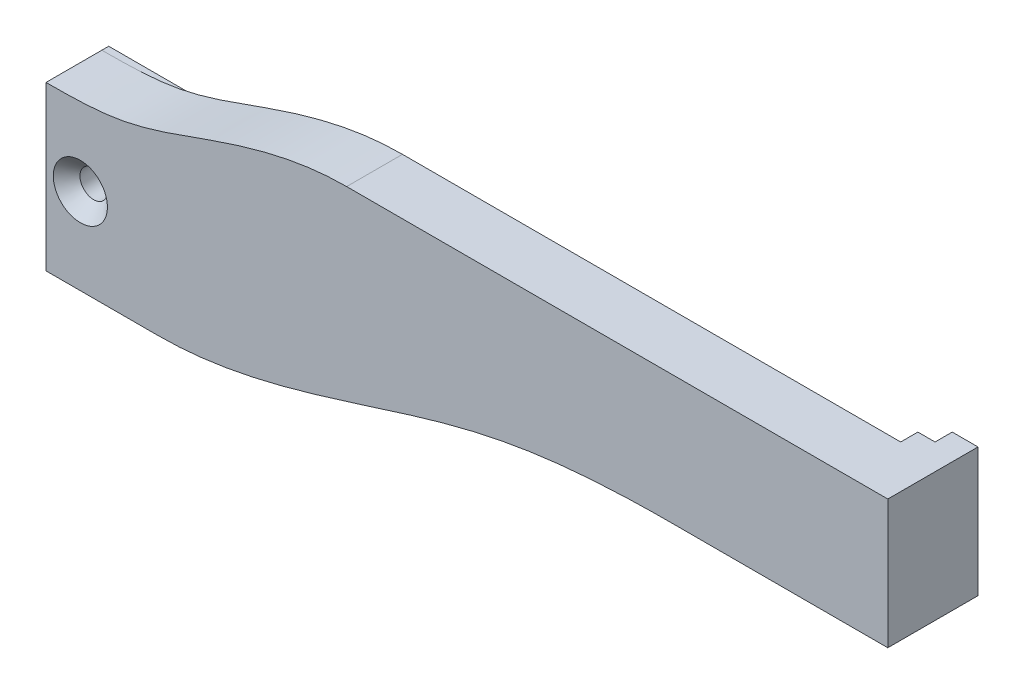
ISO-10303-21;
HEADER;
FILE_DESCRIPTION(('STEP AP214'),'2;1');
FILE_NAME('part.step','',(''),(''),'','','');
FILE_SCHEMA(('AUTOMOTIVE_DESIGN { 1 0 10303 214 1 1 1 1 }'));
ENDSEC;
DATA;
#1=APPLICATION_CONTEXT('core data for automotive mechanical design processes');
#2=APPLICATION_PROTOCOL_DEFINITION('international standard','automotive_design',2000,#1);
#3=PRODUCT_CONTEXT('',#1,'mechanical');
#4=PRODUCT('Part','Part','',(#3));
#5=PRODUCT_RELATED_PRODUCT_CATEGORY('part','',(#4));
#6=PRODUCT_DEFINITION_FORMATION('','',#4);
#7=PRODUCT_DEFINITION_CONTEXT('part definition',#1,'design');
#8=PRODUCT_DEFINITION('design','',#6,#7);
#9=PRODUCT_DEFINITION_SHAPE('','',#8);
#10=(LENGTH_UNIT() NAMED_UNIT(*) SI_UNIT(.MILLI.,.METRE.));
#11=(NAMED_UNIT(*) PLANE_ANGLE_UNIT() SI_UNIT($,.RADIAN.));
#12=(NAMED_UNIT(*) SI_UNIT($,.STERADIAN.) SOLID_ANGLE_UNIT());
#13=UNCERTAINTY_MEASURE_WITH_UNIT(LENGTH_MEASURE(1.E-05),#10,'distance_accuracy_value','');
#14=(GEOMETRIC_REPRESENTATION_CONTEXT(3) GLOBAL_UNCERTAINTY_ASSIGNED_CONTEXT((#13)) GLOBAL_UNIT_ASSIGNED_CONTEXT((#10,
#11,#12)) REPRESENTATION_CONTEXT('',''));
#15=CARTESIAN_POINT('',(0.,0.,0.));
#16=DIRECTION('',(0.,0.,1.));
#17=DIRECTION('',(1.,0.,0.));
#18=AXIS2_PLACEMENT_3D('',#15,#16,#17);
#19=CARTESIAN_POINT('',(0.,0.,0.));
#20=DIRECTION('',(0.,0.,-1.));
#21=DIRECTION('',(-1.,0.,0.));
#22=AXIS2_PLACEMENT_3D('',#19,#20,#21);
#23=PLANE('',#22);
#24=CARTESIAN_POINT('',(-49.7226680854989,56.4584902718559,0.));
#25=DIRECTION('',(0.,0.,-1.));
#26=DIRECTION('',(-1.,0.,0.));
#27=AXIS2_PLACEMENT_3D('',#24,#25,#26);
#28=CIRCLE('',#27,1.59999999999999);
#29=CARTESIAN_POINT('',(-51.3226680854989,56.4584902718559,0.));
#30=VERTEX_POINT('',#29);
#31=EDGE_CURVE('E40',#30,#30,#28,.T.);
#32=ORIENTED_EDGE('',*,*,#31,.F.);
#33=EDGE_LOOP('',(#32));
#34=FACE_BOUND('',#33,.T.);
#35=CARTESIAN_POINT('',(-44.1226680854821,62.0584902718545,0.));
#36=DIRECTION('',(0.,0.,1.));
#37=DIRECTION('',(-1.,0.,0.));
#38=AXIS2_PLACEMENT_3D('',#35,#36,#37);
#39=CIRCLE('',#38,0.899999999999998);
#40=CARTESIAN_POINT('',(-43.2226680854821,62.0584902718545,0.));
#41=VERTEX_POINT('',#40);
#42=CARTESIAN_POINT('',(-44.1226680854821,62.9584902718545,0.));
#43=VERTEX_POINT('',#42);
#44=EDGE_CURVE('E246',#41,#43,#39,.T.);
#45=ORIENTED_EDGE('',*,*,#44,.F.);
#46=DIRECTION('',(0.,1.,0.));
#47=VECTOR('',#46,1.);
#48=CARTESIAN_POINT('',(-43.2226680854821,62.0584902718545,0.));
#49=LINE('',#48,#47);
#50=CARTESIAN_POINT('',(-43.2226680854821,46.4584902718545,0.));
#51=VERTEX_POINT('',#50);
#52=EDGE_CURVE('E224',#51,#41,#49,.T.);
#53=ORIENTED_EDGE('',*,*,#52,.F.);
#54=DIRECTION('',(1.,0.,0.));
#55=VECTOR('',#54,1.);
#56=CARTESIAN_POINT('',(-53.7226680854821,46.4584902718545,0.));
#57=LINE('',#56,#55);
#58=CARTESIAN_POINT('',(-53.7226680854821,46.4584902718545,0.));
#59=VERTEX_POINT('',#58);
#60=EDGE_CURVE('E358',#59,#51,#57,.T.);
#61=ORIENTED_EDGE('',*,*,#60,.F.);
#62=DIRECTION('',(0.,-1.,0.));
#63=VECTOR('',#62,1.);
#64=CARTESIAN_POINT('',(-53.7226680854821,46.4584902718545,0.));
#65=LINE('',#64,#63);
#66=CARTESIAN_POINT('',(-53.7226680854821,62.9584902718545,0.));
#67=VERTEX_POINT('',#66);
#68=EDGE_CURVE('E345',#67,#59,#65,.T.);
#69=ORIENTED_EDGE('',*,*,#68,.F.);
#70=DIRECTION('',(-1.,0.,0.));
#71=VECTOR('',#70,1.);
#72=CARTESIAN_POINT('',(-53.7226680854821,62.9584902718545,0.));
#73=LINE('',#72,#71);
#74=EDGE_CURVE('E248',#43,#67,#73,.T.);
#75=ORIENTED_EDGE('',*,*,#74,.F.);
#76=EDGE_LOOP('',(#45,#53,#61,#69,#75));
#77=FACE_BOUND('',#76,.T.);
#78=ADVANCED_FACE('F35',(#34,#77),#23,.T.);
#79=CARTESIAN_POINT('',(-19.6476680854999,68.8834902718559,0.));
#80=DIRECTION('',(0.,0.,-1.));
#81=DIRECTION('',(-1.,0.,0.));
#82=AXIS2_PLACEMENT_3D('',#79,#80,#81);
#83=CIRCLE('',#82,2.);
#84=CARTESIAN_POINT('',(-21.6476680854999,68.8834902718559,0.));
#85=VERTEX_POINT('',#84);
#86=EDGE_CURVE('E526',#85,#85,#83,.T.);
#87=ORIENTED_EDGE('',*,*,#86,.F.);
#88=EDGE_LOOP('',(#87));
#89=FACE_BOUND('',#88,.T.);
#90=DIRECTION('',(0.707106781186547,-0.707106781186547,0.));
#91=VECTOR('',#90,1.);
#92=CARTESIAN_POINT('',(-40.7226680854821,64.9584902718545,0.));
#93=LINE('',#92,#91);
#94=CARTESIAN_POINT('',(-41.2226680854821,65.4584902718545,0.));
#95=VERTEX_POINT('',#94);
#96=CARTESIAN_POINT('',(-40.7226680854821,64.9584902718545,0.));
#97=VERTEX_POINT('',#96);
#98=EDGE_CURVE('E252',#95,#97,#93,.T.);
#99=ORIENTED_EDGE('',*,*,#98,.F.);
#100=DIRECTION('',(1.,0.,0.));
#101=VECTOR('',#100,1.);
#102=CARTESIAN_POINT('',(-41.2226680854821,65.4584902718545,0.));
#103=LINE('',#102,#101);
#104=CARTESIAN_POINT('',(-53.7226680854821,65.4584902718545,0.));
#105=VERTEX_POINT('',#104);
#106=EDGE_CURVE('E250',#105,#95,#103,.T.);
#107=ORIENTED_EDGE('',*,*,#106,.F.);
#108=CARTESIAN_POINT('',(-18.7226680854821,72.4584902718545,0.));
#109=CARTESIAN_POINT('',(-24.2377853639958,72.4584902718545,0.));
#110=CARTESIAN_POINT('',(-33.0451653637559,69.9964648024946,0.));
#111=CARTESIAN_POINT('',(-44.1783998760169,65.5488965573523,0.));
#112=CARTESIAN_POINT('',(-50.961091510957,65.4584902718545,0.));
#113=CARTESIAN_POINT('',(-53.7226680854821,65.4584902718545,0.));
#114=B_SPLINE_CURVE_WITH_KNOTS('',3,(#108,#109,#110,#111,#112,#113),.UNSPECIFIED.,.F.,.F.,(4,1,
1,4),(0.,0.451492406228631,0.761184280868583,1.),.UNSPECIFIED.);
#115=CARTESIAN_POINT('',(-18.7226680854821,72.4584902718545,0.));
#116=VERTEX_POINT('',#115);
#117=EDGE_CURVE('E367',#116,#105,#114,.T.);
#118=ORIENTED_EDGE('',*,*,#117,.F.);
#119=DIRECTION('',(-1.,0.,0.));
#120=VECTOR('',#119,1.);
#121=CARTESIAN_POINT('',(-53.7226680854821,72.4584902718545,0.));
#122=LINE('',#121,#120);
#123=CARTESIAN_POINT('',(39.2773319145179,72.4584902718545,0.));
#124=VERTEX_POINT('',#123);
#125=EDGE_CURVE('E349',#124,#116,#122,.T.);
#126=ORIENTED_EDGE('',*,*,#125,.F.);
#127=DIRECTION('',(0.,1.,0.));
#128=VECTOR('',#127,1.);
#129=CARTESIAN_POINT('',(39.2773319145179,70.4584902718545,0.));
#130=LINE('',#129,#128);
#131=CARTESIAN_POINT('',(39.2773319145179,70.4584902718545,0.));
#132=VERTEX_POINT('',#131);
#133=EDGE_CURVE('E333',#132,#124,#130,.T.);
#134=ORIENTED_EDGE('',*,*,#133,.F.);
#135=DIRECTION('',(-1.,0.,0.));
#136=VECTOR('',#135,1.);
#137=CARTESIAN_POINT('',(42.2773319145179,70.4584902718545,0.));
#138=LINE('',#137,#136);
#139=CARTESIAN_POINT('',(42.2773319145179,70.4584902718545,0.));
#140=VERTEX_POINT('',#139);
#141=EDGE_CURVE('E330',#140,#132,#138,.T.);
#142=ORIENTED_EDGE('',*,*,#141,.F.);
#143=DIRECTION('',(0.,1.,0.));
#144=VECTOR('',#143,1.);
#145=CARTESIAN_POINT('',(42.2773319145179,57.4584902718545,0.));
#146=LINE('',#145,#144);
#147=CARTESIAN_POINT('',(42.2773319145179,57.4584902718545,0.));
#148=VERTEX_POINT('',#147);
#149=EDGE_CURVE('E320',#148,#140,#146,.T.);
#150=ORIENTED_EDGE('',*,*,#149,.F.);
#151=DIRECTION('',(1.,0.,0.));
#152=VECTOR('',#151,1.);
#153=CARTESIAN_POINT('',(0.,57.4584902718545,0.));
#154=LINE('',#153,#152);
#155=CARTESIAN_POINT('',(19.2773319145179,57.4584902718545,0.));
#156=VERTEX_POINT('',#155);
#157=EDGE_CURVE('E317',#156,#148,#154,.T.);
#158=ORIENTED_EDGE('',*,*,#157,.F.);
#159=CARTESIAN_POINT('',(-40.7226680854821,46.4584902718545,0.));
#160=CARTESIAN_POINT('',(-29.5295788319542,46.4584902718546,0.));
#161=CARTESIAN_POINT('',(-8.90412174148208,55.1540178434076,0.));
#162=CARTESIAN_POINT('',(7.83294299235179,57.4584902718545,0.));
#163=CARTESIAN_POINT('',(19.2773319145179,57.4584902718545,0.));
#164=B_SPLINE_CURVE_WITH_KNOTS('',3,(#159,#160,#161,#162,#163),.UNSPECIFIED.,.F.,.F.,(4,1,4),
(0.,0.551294404892798,1.),.UNSPECIFIED.);
#165=CARTESIAN_POINT('',(-40.7226680854821,46.4584902718545,0.));
#166=VERTEX_POINT('',#165);
#167=EDGE_CURVE('E372',#166,#156,#164,.T.);
#168=ORIENTED_EDGE('',*,*,#167,.F.);
#169=DIRECTION('',(0.,-1.,0.));
#170=VECTOR('',#169,1.);
#171=CARTESIAN_POINT('',(-40.7226680854821,46.4584902718545,0.));
#172=LINE('',#171,#170);
#173=EDGE_CURVE('E229',#97,#166,#172,.T.);
#174=ORIENTED_EDGE('',*,*,#173,.F.);
#175=EDGE_LOOP('',(#99,#107,#118,#126,#134,#142,#150,#158,#168,#174));
#176=FACE_BOUND('',#175,.T.);
#177=ADVANCED_FACE('F413',(#89,#176),#23,.T.);
#178=CARTESIAN_POINT('',(-53.7226680854821,46.4584902718545,6.5));
#179=DIRECTION('',(0.,1.,0.));
#180=DIRECTION('',(0.,0.,1.));
#181=AXIS2_PLACEMENT_3D('',#178,#179,#180);
#182=PLANE('',#181);
#183=DIRECTION('',(0.,0.,-1.));
#184=VECTOR('',#183,1.);
#185=CARTESIAN_POINT('',(-40.7226680854821,46.4584902718545,6.5));
#186=LINE('',#185,#184);
#187=CARTESIAN_POINT('',(-40.7226680854821,46.4584902718545,6.5));
#188=VERTEX_POINT('',#187);
#189=EDGE_CURVE('E310',#188,#166,#186,.T.);
#190=ORIENTED_EDGE('',*,*,#189,.F.);
#191=DIRECTION('',(1.,0.,0.));
#192=VECTOR('',#191,1.);
#193=CARTESIAN_POINT('',(-53.7226680854821,46.4584902718545,6.5));
#194=LINE('',#193,#192);
#195=CARTESIAN_POINT('',(-53.7226680854821,46.4584902718545,6.5));
#196=VERTEX_POINT('',#195);
#197=EDGE_CURVE('E348',#196,#188,#194,.T.);
#198=ORIENTED_EDGE('',*,*,#197,.F.);
#199=DIRECTION('',(0.,0.,-1.));
#200=VECTOR('',#199,1.);
#201=CARTESIAN_POINT('',(-53.7226680854821,46.4584902718545,6.5));
#202=LINE('',#201,#200);
#203=EDGE_CURVE('E364',#196,#59,#202,.T.);
#204=ORIENTED_EDGE('',*,*,#203,.T.);
#205=ORIENTED_EDGE('',*,*,#60,.T.);
#206=DIRECTION('',(0.,0.,1.));
#207=VECTOR('',#206,1.);
#208=CARTESIAN_POINT('',(-43.2226680854821,46.4584902718545,-0.8));
#209=LINE('',#208,#207);
#210=CARTESIAN_POINT('',(-43.2226680854821,46.4584902718545,-0.8));
#211=VERTEX_POINT('',#210);
#212=EDGE_CURVE('E243',#211,#51,#209,.T.);
#213=ORIENTED_EDGE('',*,*,#212,.F.);
#214=DIRECTION('',(-1.,0.,0.));
#215=VECTOR('',#214,1.);
#216=CARTESIAN_POINT('',(-43.2226680854821,46.4584902718545,-0.8));
#217=LINE('',#216,#215);
#218=CARTESIAN_POINT('',(-40.7226680854821,46.4584902718545,-0.8));
#219=VERTEX_POINT('',#218);
#220=EDGE_CURVE('E241',#219,#211,#217,.T.);
#221=ORIENTED_EDGE('',*,*,#220,.F.);
#222=DIRECTION('',(0.,0.,1.));
#223=VECTOR('',#222,1.);
#224=CARTESIAN_POINT('',(-40.7226680854821,46.4584902718545,-0.8));
#225=LINE('',#224,#223);
#226=EDGE_CURVE('E257',#219,#166,#225,.T.);
#227=ORIENTED_EDGE('',*,*,#226,.T.);
#228=EDGE_LOOP('',(#190,#198,#204,#205,#213,#221,#227));
#229=FACE_BOUND('',#228,.T.);
#230=ADVANCED_FACE('F435',(#229),#182,.F.);
#231=CARTESIAN_POINT('',(-53.7226680854821,72.4584902718545,6.5));
#232=DIRECTION('',(0.,-1.,0.));
#233=DIRECTION('',(0.,0.,-1.));
#234=AXIS2_PLACEMENT_3D('',#231,#232,#233);
#235=PLANE('',#234);
#236=DIRECTION('',(0.,0.,-1.));
#237=VECTOR('',#236,1.);
#238=CARTESIAN_POINT('',(-18.7226680854821,72.4584902718545,6.5));
#239=LINE('',#238,#237);
#240=CARTESIAN_POINT('',(-18.7226680854821,72.4584902718545,6.5));
#241=VERTEX_POINT('',#240);
#242=EDGE_CURVE('E283',#241,#116,#239,.T.);
#243=ORIENTED_EDGE('',*,*,#242,.F.);
#244=DIRECTION('',(-1.,0.,0.));
#245=VECTOR('',#244,1.);
#246=CARTESIAN_POINT('',(-53.7226680854821,72.4584902718545,6.5));
#247=LINE('',#246,#245);
#248=CARTESIAN_POINT('',(44.2773319145179,72.4584902718545,6.5));
#249=VERTEX_POINT('',#248);
#250=EDGE_CURVE('E353',#249,#241,#247,.T.);
#251=ORIENTED_EDGE('',*,*,#250,.F.);
#252=DIRECTION('',(0.,0.,-1.));
#253=VECTOR('',#252,1.);
#254=CARTESIAN_POINT('',(44.2773319145179,72.4584902718545,6.5));
#255=LINE('',#254,#253);
#256=CARTESIAN_POINT('',(44.2773319145179,72.4584902718545,-4.));
#257=VERTEX_POINT('',#256);
#258=EDGE_CURVE('E356',#249,#257,#255,.T.);
#259=ORIENTED_EDGE('',*,*,#258,.T.);
#260=DIRECTION('',(1.,0.,0.));
#261=VECTOR('',#260,1.);
#262=CARTESIAN_POINT('',(44.2773319145179,72.4584902718545,-4.));
#263=LINE('',#262,#261);
#264=CARTESIAN_POINT('',(41.2773319145179,72.4584902718545,-4.));
#265=VERTEX_POINT('',#264);
#266=EDGE_CURVE('E206',#265,#257,#263,.T.);
#267=ORIENTED_EDGE('',*,*,#266,.F.);
#268=DIRECTION('',(0.,0.,1.));
#269=VECTOR('',#268,1.);
#270=CARTESIAN_POINT('',(41.2773319145179,72.4584902718545,-4.));
#271=LINE('',#270,#269);
#272=CARTESIAN_POINT('',(41.2773319145179,72.4584902718545,-2.));
#273=VERTEX_POINT('',#272);
#274=EDGE_CURVE('E219',#265,#273,#271,.T.);
#275=ORIENTED_EDGE('',*,*,#274,.T.);
#276=DIRECTION('',(1.,0.,0.));
#277=VECTOR('',#276,1.);
#278=CARTESIAN_POINT('',(39.2773319145179,72.4584902718545,-2.));
#279=LINE('',#278,#277);
#280=CARTESIAN_POINT('',(39.2773319145179,72.4584902718545,-2.));
#281=VERTEX_POINT('',#280);
#282=EDGE_CURVE('E192',#281,#273,#279,.T.);
#283=ORIENTED_EDGE('',*,*,#282,.F.);
#284=DIRECTION('',(0.,0.,1.));
#285=VECTOR('',#284,1.);
#286=CARTESIAN_POINT('',(39.2773319145179,72.4584902718545,-2.));
#287=LINE('',#286,#285);
#288=EDGE_CURVE('E191',#281,#124,#287,.T.);
#289=ORIENTED_EDGE('',*,*,#288,.T.);
#290=ORIENTED_EDGE('',*,*,#125,.T.);
#291=EDGE_LOOP('',(#243,#251,#259,#267,#275,#283,#289,#290));
#292=FACE_BOUND('',#291,.T.);
#293=ADVANCED_FACE('F400',(#292),#235,.F.);
#294=CARTESIAN_POINT('',(-53.7226680854821,46.4584902718545,6.5));
#295=DIRECTION('',(1.,0.,0.));
#296=DIRECTION('',(0.,0.,-1.));
#297=AXIS2_PLACEMENT_3D('',#294,#295,#296);
#298=PLANE('',#297);
#299=DIRECTION('',(0.,-1.,0.));
#300=VECTOR('',#299,1.);
#301=CARTESIAN_POINT('',(-53.7226680854821,46.4584902718545,6.5));
#302=LINE('',#301,#300);
#303=CARTESIAN_POINT('',(-53.7226680854821,65.4584902718545,6.5));
#304=VERTEX_POINT('',#303);
#305=EDGE_CURVE('E346',#304,#196,#302,.T.);
#306=ORIENTED_EDGE('',*,*,#305,.F.);
#307=DIRECTION('',(0.,0.,-1.));
#308=VECTOR('',#307,1.);
#309=CARTESIAN_POINT('',(-53.7226680854821,65.4584902718545,6.5));
#310=LINE('',#309,#308);
#311=EDGE_CURVE('E309',#304,#105,#310,.T.);
#312=ORIENTED_EDGE('',*,*,#311,.T.);
#313=DIRECTION('',(0.,0.,1.));
#314=VECTOR('',#313,1.);
#315=CARTESIAN_POINT('',(-53.7226680854821,65.4584902718545,-0.8));
#316=LINE('',#315,#314);
#317=CARTESIAN_POINT('',(-53.7226680854821,65.4584902718545,-0.8));
#318=VERTEX_POINT('',#317);
#319=EDGE_CURVE('E265',#318,#105,#316,.T.);
#320=ORIENTED_EDGE('',*,*,#319,.F.);
#321=DIRECTION('',(0.,1.,0.));
#322=VECTOR('',#321,1.);
#323=CARTESIAN_POINT('',(-53.7226680854821,65.4584902718545,-0.8));
#324=LINE('',#323,#322);
#325=CARTESIAN_POINT('',(-53.7226680854821,62.9584902718545,-0.8));
#326=VERTEX_POINT('',#325);
#327=EDGE_CURVE('E233',#326,#318,#324,.T.);
#328=ORIENTED_EDGE('',*,*,#327,.F.);
#329=DIRECTION('',(0.,0.,1.));
#330=VECTOR('',#329,1.);
#331=CARTESIAN_POINT('',(-53.7226680854821,62.9584902718545,-0.8));
#332=LINE('',#331,#330);
#333=EDGE_CURVE('E267',#326,#67,#332,.T.);
#334=ORIENTED_EDGE('',*,*,#333,.T.);
#335=ORIENTED_EDGE('',*,*,#68,.T.);
#336=ORIENTED_EDGE('',*,*,#203,.F.);
#337=EDGE_LOOP('',(#306,#312,#320,#328,#334,#335,#336));
#338=FACE_BOUND('',#337,.T.);
#339=ADVANCED_FACE('F444',(#338),#298,.F.);
#340=CARTESIAN_POINT('',(44.2773319145179,46.4584902718545,6.5));
#341=DIRECTION('',(-1.,0.,0.));
#342=DIRECTION('',(0.,-1.,0.));
#343=AXIS2_PLACEMENT_3D('',#340,#341,#342);
#344=PLANE('',#343);
#345=DIRECTION('',(0.,1.,0.));
#346=VECTOR('',#345,1.);
#347=CARTESIAN_POINT('',(44.2773319145179,46.4584902718545,6.5));
#348=LINE('',#347,#346);
#349=CARTESIAN_POINT('',(44.2773319145179,57.4584902718545,6.5));
#350=VERTEX_POINT('',#349);
#351=EDGE_CURVE('E187',#350,#249,#348,.T.);
#352=ORIENTED_EDGE('',*,*,#351,.F.);
#353=DIRECTION('',(0.,0.,1.));
#354=VECTOR('',#353,1.);
#355=CARTESIAN_POINT('',(44.2773319145179,57.4584902718545,-2.));
#356=LINE('',#355,#354);
#357=CARTESIAN_POINT('',(44.2773319145179,57.4584902718545,-4.));
#358=VERTEX_POINT('',#357);
#359=EDGE_CURVE('E181',#358,#350,#356,.T.);
#360=ORIENTED_EDGE('',*,*,#359,.F.);
#361=DIRECTION('',(0.,-1.,0.));
#362=VECTOR('',#361,1.);
#363=CARTESIAN_POINT('',(44.2773319145179,72.4584902718545,-4.));
#364=LINE('',#363,#362);
#365=EDGE_CURVE('E186',#257,#358,#364,.T.);
#366=ORIENTED_EDGE('',*,*,#365,.F.);
#367=ORIENTED_EDGE('',*,*,#258,.F.);
#368=EDGE_LOOP('',(#352,#360,#366,#367));
#369=FACE_BOUND('',#368,.T.);
#370=ADVANCED_FACE('F183',(#369),#344,.F.);
#371=CARTESIAN_POINT('',(0.,0.,6.5));
#372=DIRECTION('',(0.,0.,-1.));
#373=DIRECTION('',(-1.,0.,0.));
#374=AXIS2_PLACEMENT_3D('',#371,#372,#373);
#375=PLANE('',#374);
#376=CARTESIAN_POINT('',(-49.7226680854989,56.4584902718559,6.5));
#377=DIRECTION('',(0.,0.,1.));
#378=DIRECTION('',(1.,0.,0.));
#379=AXIS2_PLACEMENT_3D('',#376,#377,#378);
#380=CIRCLE('',#379,3.15);
#381=CARTESIAN_POINT('',(-46.5726680854989,56.4584902718559,6.5));
#382=VERTEX_POINT('',#381);
#383=EDGE_CURVE('E525',#382,#382,#380,.T.);
#384=ORIENTED_EDGE('',*,*,#383,.F.);
#385=EDGE_LOOP('',(#384));
#386=FACE_BOUND('',#385,.T.);
#387=CARTESIAN_POINT('',(-40.7226680854821,46.4584902718545,6.5));
#388=CARTESIAN_POINT('',(-29.5295788319542,46.4584902718546,6.5));
#389=CARTESIAN_POINT('',(-8.90412174148208,55.1540178434076,6.5));
#390=CARTESIAN_POINT('',(7.83294299235179,57.4584902718545,6.5));
#391=CARTESIAN_POINT('',(19.2773319145179,57.4584902718545,6.5));
#392=B_SPLINE_CURVE_WITH_KNOTS('',3,(#387,#388,#389,#390,#391),.UNSPECIFIED.,.F.,.F.,(4,1,4),
(0.,0.551294404892798,1.),.UNSPECIFIED.);
#393=CARTESIAN_POINT('',(19.2773319145179,57.4584902718545,6.5));
#394=VERTEX_POINT('',#393);
#395=EDGE_CURVE('E276',#188,#394,#392,.T.);
#396=ORIENTED_EDGE('',*,*,#395,.T.);
#397=DIRECTION('',(1.,0.,0.));
#398=VECTOR('',#397,1.);
#399=CARTESIAN_POINT('',(44.2773319145179,57.4584902718545,6.5));
#400=LINE('',#399,#398);
#401=EDGE_CURVE('E282',#394,#350,#400,.T.);
#402=ORIENTED_EDGE('',*,*,#401,.T.);
#403=ORIENTED_EDGE('',*,*,#351,.T.);
#404=ORIENTED_EDGE('',*,*,#250,.T.);
#405=CARTESIAN_POINT('',(-18.7226680854821,72.4584902718545,6.5));
#406=CARTESIAN_POINT('',(-24.2377853639958,72.4584902718545,6.5));
#407=CARTESIAN_POINT('',(-33.0451653637559,69.9964648024946,6.5));
#408=CARTESIAN_POINT('',(-44.1783998760169,65.5488965573523,6.5));
#409=CARTESIAN_POINT('',(-50.961091510957,65.4584902718545,6.5));
#410=CARTESIAN_POINT('',(-53.7226680854821,65.4584902718545,6.5));
#411=B_SPLINE_CURVE_WITH_KNOTS('',3,(#405,#406,#407,#408,#409,#410),.UNSPECIFIED.,.F.,.F.,(4,1,
1,4),(0.,0.451492406228631,0.761184280868583,1.),.UNSPECIFIED.);
#412=EDGE_CURVE('E275',#241,#304,#411,.T.);
#413=ORIENTED_EDGE('',*,*,#412,.T.);
#414=ORIENTED_EDGE('',*,*,#305,.T.);
#415=ORIENTED_EDGE('',*,*,#197,.T.);
#416=EDGE_LOOP('',(#396,#402,#403,#404,#413,#414,#415));
#417=FACE_BOUND('',#416,.T.);
#418=ADVANCED_FACE('F403',(#386,#417),#375,.F.);
#419=CARTESIAN_POINT('',(44.2773319145179,57.4584902718545,-2.));
#420=DIRECTION('',(0.,1.,0.));
#421=DIRECTION('',(0.,0.,1.));
#422=AXIS2_PLACEMENT_3D('',#419,#420,#421);
#423=PLANE('',#422);
#424=ORIENTED_EDGE('',*,*,#359,.T.);
#425=ORIENTED_EDGE('',*,*,#401,.F.);
#426=DIRECTION('',(0.,0.,-1.));
#427=VECTOR('',#426,1.);
#428=CARTESIAN_POINT('',(19.2773319145179,57.4584902718545,6.5));
#429=LINE('',#428,#427);
#430=EDGE_CURVE('E321',#394,#156,#429,.T.);
#431=ORIENTED_EDGE('',*,*,#430,.T.);
#432=ORIENTED_EDGE('',*,*,#157,.T.);
#433=DIRECTION('',(0.,0.,1.));
#434=VECTOR('',#433,1.);
#435=CARTESIAN_POINT('',(42.2773319145179,57.4584902718545,-2.));
#436=LINE('',#435,#434);
#437=CARTESIAN_POINT('',(42.2773319145179,57.4584902718545,-1.2));
#438=VERTEX_POINT('',#437);
#439=EDGE_CURVE('E343',#438,#148,#436,.T.);
#440=ORIENTED_EDGE('',*,*,#439,.F.);
#441=DIRECTION('',(0.707106781186548,0.,0.707106781186548));
#442=VECTOR('',#441,1.);
#443=CARTESIAN_POINT('',(42.8773319145179,57.4584902718545,-0.600000000000002));
#444=LINE('',#443,#442);
#445=CARTESIAN_POINT('',(41.4773319145179,57.4584902718545,-2.));
#446=VERTEX_POINT('',#445);
#447=EDGE_CURVE('E11',#438,#446,#444,.F.);
#448=ORIENTED_EDGE('',*,*,#447,.T.);
#449=DIRECTION('',(-1.,0.,0.));
#450=VECTOR('',#449,1.);
#451=CARTESIAN_POINT('',(44.2773319145179,57.4584902718545,-2.));
#452=LINE('',#451,#450);
#453=CARTESIAN_POINT('',(41.2773319145179,57.4584902718545,-2.));
#454=VERTEX_POINT('',#453);
#455=EDGE_CURVE('E210',#446,#454,#452,.T.);
#456=ORIENTED_EDGE('',*,*,#455,.T.);
#457=DIRECTION('',(0.,0.,1.));
#458=VECTOR('',#457,1.);
#459=CARTESIAN_POINT('',(41.2773319145179,57.4584902718545,-4.));
#460=LINE('',#459,#458);
#461=CARTESIAN_POINT('',(41.2773319145179,57.4584902718545,-4.));
#462=VERTEX_POINT('',#461);
#463=EDGE_CURVE('E198',#462,#454,#460,.T.);
#464=ORIENTED_EDGE('',*,*,#463,.F.);
#465=DIRECTION('',(-1.,0.,0.));
#466=VECTOR('',#465,1.);
#467=CARTESIAN_POINT('',(44.2773319145179,57.4584902718545,-4.));
#468=LINE('',#467,#466);
#469=EDGE_CURVE('E195',#358,#462,#468,.T.);
#470=ORIENTED_EDGE('',*,*,#469,.F.);
#471=EDGE_LOOP('',(#424,#425,#431,#432,#440,#448,#456,#464,#470));
#472=FACE_BOUND('',#471,.T.);
#473=ADVANCED_FACE('F196',(#472),#423,.F.);
#474=CARTESIAN_POINT('',(42.2773319145179,57.4584902718545,-2.));
#475=DIRECTION('',(1.,0.,0.));
#476=DIRECTION('',(0.,0.,-1.));
#477=AXIS2_PLACEMENT_3D('',#474,#475,#476);
#478=PLANE('',#477);
#479=DIRECTION('',(0.,0.,1.));
#480=VECTOR('',#479,1.);
#481=CARTESIAN_POINT('',(42.2773319145179,70.4584902718545,-2.));
#482=LINE('',#481,#480);
#483=CARTESIAN_POINT('',(42.2773319145179,70.4584902718545,-1.2));
#484=VERTEX_POINT('',#483);
#485=EDGE_CURVE('E341',#484,#140,#482,.T.);
#486=ORIENTED_EDGE('',*,*,#485,.F.);
#487=DIRECTION('',(0.,-1.,0.));
#488=VECTOR('',#487,1.);
#489=CARTESIAN_POINT('',(42.2773319145179,57.4584902718545,-1.2));
#490=LINE('',#489,#488);
#491=EDGE_CURVE('E45',#484,#438,#490,.T.);
#492=ORIENTED_EDGE('',*,*,#491,.T.);
#493=ORIENTED_EDGE('',*,*,#439,.T.);
#494=ORIENTED_EDGE('',*,*,#149,.T.);
#495=EDGE_LOOP('',(#486,#492,#493,#494));
#496=FACE_BOUND('',#495,.T.);
#497=ADVANCED_FACE('F416',(#496),#478,.F.);
#498=CARTESIAN_POINT('',(42.2773319145179,70.4584902718545,-2.));
#499=DIRECTION('',(0.,1.,0.));
#500=DIRECTION('',(0.,0.,1.));
#501=AXIS2_PLACEMENT_3D('',#498,#499,#500);
#502=PLANE('',#501);
#503=DIRECTION('',(-1.,0.,0.));
#504=VECTOR('',#503,1.);
#505=CARTESIAN_POINT('',(42.2773319145179,70.4584902718545,-2.));
#506=LINE('',#505,#504);
#507=CARTESIAN_POINT('',(41.4773319145179,70.4584902718545,-2.));
#508=VERTEX_POINT('',#507);
#509=CARTESIAN_POINT('',(41.2773319145179,70.4584902718545,-2.));
#510=VERTEX_POINT('',#509);
#511=EDGE_CURVE('E322',#508,#510,#506,.T.);
#512=ORIENTED_EDGE('',*,*,#511,.F.);
#513=DIRECTION('',(-0.707106781186548,0.,-0.707106781186548));
#514=VECTOR('',#513,1.);
#515=CARTESIAN_POINT('',(41.4773319145179,70.4584902718545,-2.));
#516=LINE('',#515,#514);
#517=EDGE_CURVE('E59',#508,#484,#516,.F.);
#518=ORIENTED_EDGE('',*,*,#517,.T.);
#519=ORIENTED_EDGE('',*,*,#485,.T.);
#520=ORIENTED_EDGE('',*,*,#141,.T.);
#521=DIRECTION('',(0.,0.,1.));
#522=VECTOR('',#521,1.);
#523=CARTESIAN_POINT('',(39.2773319145179,70.4584902718545,-2.));
#524=LINE('',#523,#522);
#525=CARTESIAN_POINT('',(39.2773319145179,70.4584902718545,-2.));
#526=VERTEX_POINT('',#525);
#527=EDGE_CURVE('E338',#526,#132,#524,.T.);
#528=ORIENTED_EDGE('',*,*,#527,.F.);
#529=EDGE_CURVE('E325',#510,#526,#506,.T.);
#530=ORIENTED_EDGE('',*,*,#529,.F.);
#531=EDGE_LOOP('',(#512,#518,#519,#520,#528,#530));
#532=FACE_BOUND('',#531,.T.);
#533=ADVANCED_FACE('F547',(#532),#502,.F.);
#534=CARTESIAN_POINT('',(39.2773319145179,70.4584902718545,-2.));
#535=DIRECTION('',(1.,0.,0.));
#536=DIRECTION('',(0.,0.,-1.));
#537=AXIS2_PLACEMENT_3D('',#534,#535,#536);
#538=PLANE('',#537);
#539=ORIENTED_EDGE('',*,*,#133,.T.);
#540=ORIENTED_EDGE('',*,*,#288,.F.);
#541=DIRECTION('',(0.,1.,0.));
#542=VECTOR('',#541,1.);
#543=CARTESIAN_POINT('',(39.2773319145179,70.4584902718545,-2.));
#544=LINE('',#543,#542);
#545=EDGE_CURVE('E324',#526,#281,#544,.T.);
#546=ORIENTED_EDGE('',*,*,#545,.F.);
#547=ORIENTED_EDGE('',*,*,#527,.T.);
#548=EDGE_LOOP('',(#539,#540,#546,#547));
#549=FACE_BOUND('',#548,.T.);
#550=ADVANCED_FACE('F551',(#549),#538,.F.);
#551=CARTESIAN_POINT('',(0.,0.,-2.));
#552=DIRECTION('',(0.,0.,-1.));
#553=DIRECTION('',(-1.,0.,0.));
#554=AXIS2_PLACEMENT_3D('',#551,#552,#553);
#555=PLANE('',#554);
#556=DIRECTION('',(0.,1.,0.));
#557=VECTOR('',#556,1.);
#558=CARTESIAN_POINT('',(41.2773319145179,72.4584902718545,-2.));
#559=LINE('',#558,#557);
#560=EDGE_CURVE('E212',#510,#273,#559,.T.);
#561=ORIENTED_EDGE('',*,*,#560,.F.);
#562=ORIENTED_EDGE('',*,*,#529,.T.);
#563=ORIENTED_EDGE('',*,*,#545,.T.);
#564=ORIENTED_EDGE('',*,*,#282,.T.);
#565=EDGE_LOOP('',(#561,#562,#563,#564));
#566=FACE_BOUND('',#565,.T.);
#567=ADVANCED_FACE('F300',(#566),#555,.T.);
#568=DIRECTION('',(0.,0.,-1.));
#569=VECTOR('',#568,1.);
#570=SURFACE_OF_LINEAR_EXTRUSION('',#411,#569);
#571=ORIENTED_EDGE('',*,*,#117,.T.);
#572=ORIENTED_EDGE('',*,*,#311,.F.);
#573=ORIENTED_EDGE('',*,*,#412,.F.);
#574=ORIENTED_EDGE('',*,*,#242,.T.);
#575=EDGE_LOOP('',(#571,#572,#573,#574));
#576=FACE_BOUND('',#575,.T.);
#577=ADVANCED_FACE('F294',(#576),#570,.F.);
#578=DIRECTION('',(0.,0.,-1.));
#579=VECTOR('',#578,1.);
#580=SURFACE_OF_LINEAR_EXTRUSION('',#392,#579);
#581=ORIENTED_EDGE('',*,*,#167,.T.);
#582=ORIENTED_EDGE('',*,*,#430,.F.);
#583=ORIENTED_EDGE('',*,*,#395,.F.);
#584=ORIENTED_EDGE('',*,*,#189,.T.);
#585=EDGE_LOOP('',(#581,#582,#583,#584));
#586=FACE_BOUND('',#585,.T.);
#587=ADVANCED_FACE('F289',(#586),#580,.F.);
#588=CARTESIAN_POINT('',(-43.2226680854821,62.0584902718545,-0.8));
#589=DIRECTION('',(1.,0.,0.));
#590=DIRECTION('',(0.,0.,-1.));
#591=AXIS2_PLACEMENT_3D('',#588,#589,#590);
#592=PLANE('',#591);
#593=ORIENTED_EDGE('',*,*,#52,.T.);
#594=DIRECTION('',(0.,0.,1.));
#595=VECTOR('',#594,1.);
#596=CARTESIAN_POINT('',(-43.2226680854821,62.0584902718545,-0.8));
#597=LINE('',#596,#595);
#598=CARTESIAN_POINT('',(-43.2226680854821,62.0584902718545,-0.8));
#599=VERTEX_POINT('',#598);
#600=EDGE_CURVE('E273',#599,#41,#597,.T.);
#601=ORIENTED_EDGE('',*,*,#600,.F.);
#602=DIRECTION('',(0.,1.,0.));
#603=VECTOR('',#602,1.);
#604=CARTESIAN_POINT('',(-43.2226680854821,62.0584902718545,-0.8));
#605=LINE('',#604,#603);
#606=EDGE_CURVE('E225',#211,#599,#605,.T.);
#607=ORIENTED_EDGE('',*,*,#606,.F.);
#608=ORIENTED_EDGE('',*,*,#212,.T.);
#609=EDGE_LOOP('',(#593,#601,#607,#608));
#610=FACE_BOUND('',#609,.T.);
#611=ADVANCED_FACE('F293',(#610),#592,.F.);
#612=CARTESIAN_POINT('',(-44.1226680854821,62.0584902718545,-0.8));
#613=DIRECTION('',(0.,0.,1.));
#614=DIRECTION('',(1.,0.,0.));
#615=AXIS2_PLACEMENT_3D('',#612,#613,#614);
#616=CYLINDRICAL_SURFACE('',#615,0.899999999999998);
#617=ORIENTED_EDGE('',*,*,#44,.T.);
#618=DIRECTION('',(0.,0.,1.));
#619=VECTOR('',#618,1.);
#620=CARTESIAN_POINT('',(-44.1226680854821,62.9584902718545,-0.8));
#621=LINE('',#620,#619);
#622=CARTESIAN_POINT('',(-44.1226680854821,62.9584902718545,-0.8));
#623=VERTEX_POINT('',#622);
#624=EDGE_CURVE('E270',#623,#43,#621,.T.);
#625=ORIENTED_EDGE('',*,*,#624,.F.);
#626=CARTESIAN_POINT('',(-44.1226680854821,62.0584902718545,-0.8));
#627=DIRECTION('',(0.,0.,1.));
#628=DIRECTION('',(-1.,0.,0.));
#629=AXIS2_PLACEMENT_3D('',#626,#627,#628);
#630=CIRCLE('',#629,0.899999999999998);
#631=EDGE_CURVE('E228',#599,#623,#630,.T.);
#632=ORIENTED_EDGE('',*,*,#631,.F.);
#633=ORIENTED_EDGE('',*,*,#600,.T.);
#634=EDGE_LOOP('',(#617,#625,#632,#633));
#635=FACE_BOUND('',#634,.T.);
#636=ADVANCED_FACE('F489',(#635),#616,.F.);
#637=CARTESIAN_POINT('',(-53.7226680854821,62.9584902718545,-0.8));
#638=DIRECTION('',(0.,1.,0.));
#639=DIRECTION('',(0.,0.,1.));
#640=AXIS2_PLACEMENT_3D('',#637,#638,#639);
#641=PLANE('',#640);
#642=ORIENTED_EDGE('',*,*,#74,.T.);
#643=ORIENTED_EDGE('',*,*,#333,.F.);
#644=DIRECTION('',(-1.,0.,0.));
#645=VECTOR('',#644,1.);
#646=CARTESIAN_POINT('',(-53.7226680854821,62.9584902718545,-0.8));
#647=LINE('',#646,#645);
#648=EDGE_CURVE('E231',#623,#326,#647,.T.);
#649=ORIENTED_EDGE('',*,*,#648,.F.);
#650=ORIENTED_EDGE('',*,*,#624,.T.);
#651=EDGE_LOOP('',(#642,#643,#649,#650));
#652=FACE_BOUND('',#651,.T.);
#653=ADVANCED_FACE('F480',(#652),#641,.F.);
#654=CARTESIAN_POINT('',(-41.2226680854821,65.4584902718545,-0.8));
#655=DIRECTION('',(0.,-1.,0.));
#656=DIRECTION('',(0.,0.,-1.));
#657=AXIS2_PLACEMENT_3D('',#654,#655,#656);
#658=PLANE('',#657);
#659=ORIENTED_EDGE('',*,*,#106,.T.);
#660=DIRECTION('',(0.,0.,1.));
#661=VECTOR('',#660,1.);
#662=CARTESIAN_POINT('',(-41.2226680854821,65.4584902718545,-0.8));
#663=LINE('',#662,#661);
#664=CARTESIAN_POINT('',(-41.2226680854821,65.4584902718545,-0.8));
#665=VERTEX_POINT('',#664);
#666=EDGE_CURVE('E262',#665,#95,#663,.T.);
#667=ORIENTED_EDGE('',*,*,#666,.F.);
#668=DIRECTION('',(1.,0.,0.));
#669=VECTOR('',#668,1.);
#670=CARTESIAN_POINT('',(-41.2226680854821,65.4584902718545,-0.8));
#671=LINE('',#670,#669);
#672=EDGE_CURVE('E235',#318,#665,#671,.T.);
#673=ORIENTED_EDGE('',*,*,#672,.F.);
#674=ORIENTED_EDGE('',*,*,#319,.T.);
#675=EDGE_LOOP('',(#659,#667,#673,#674));
#676=FACE_BOUND('',#675,.T.);
#677=ADVANCED_FACE('F471',(#676),#658,.F.);
#678=CARTESIAN_POINT('',(-40.7226680854821,64.9584902718545,-0.8));
#679=DIRECTION('',(-0.707106781186548,-0.707106781186548,0.));
#680=DIRECTION('',(0.707106781186548,-0.707106781186548,0.));
#681=AXIS2_PLACEMENT_3D('',#678,#679,#680);
#682=PLANE('',#681);
#683=ORIENTED_EDGE('',*,*,#98,.T.);
#684=DIRECTION('',(0.,0.,1.));
#685=VECTOR('',#684,1.);
#686=CARTESIAN_POINT('',(-40.7226680854821,64.9584902718545,-0.8));
#687=LINE('',#686,#685);
#688=CARTESIAN_POINT('',(-40.7226680854821,64.9584902718545,-0.8));
#689=VERTEX_POINT('',#688);
#690=EDGE_CURVE('E259',#689,#97,#687,.T.);
#691=ORIENTED_EDGE('',*,*,#690,.F.);
#692=DIRECTION('',(0.707106781186547,-0.707106781186547,0.));
#693=VECTOR('',#692,1.);
#694=CARTESIAN_POINT('',(-40.7226680854821,64.9584902718545,-0.8));
#695=LINE('',#694,#693);
#696=EDGE_CURVE('E237',#665,#689,#695,.T.);
#697=ORIENTED_EDGE('',*,*,#696,.F.);
#698=ORIENTED_EDGE('',*,*,#666,.T.);
#699=EDGE_LOOP('',(#683,#691,#697,#698));
#700=FACE_BOUND('',#699,.T.);
#701=ADVANCED_FACE('F466',(#700),#682,.F.);
#702=CARTESIAN_POINT('',(-40.7226680854821,46.4584902718545,-0.8));
#703=DIRECTION('',(-1.,0.,0.));
#704=DIRECTION('',(0.,0.,1.));
#705=AXIS2_PLACEMENT_3D('',#702,#703,#704);
#706=PLANE('',#705);
#707=ORIENTED_EDGE('',*,*,#173,.T.);
#708=ORIENTED_EDGE('',*,*,#226,.F.);
#709=DIRECTION('',(0.,-1.,0.));
#710=VECTOR('',#709,1.);
#711=CARTESIAN_POINT('',(-40.7226680854821,46.4584902718545,-0.8));
#712=LINE('',#711,#710);
#713=EDGE_CURVE('E239',#689,#219,#712,.T.);
#714=ORIENTED_EDGE('',*,*,#713,.F.);
#715=ORIENTED_EDGE('',*,*,#690,.T.);
#716=EDGE_LOOP('',(#707,#708,#714,#715));
#717=FACE_BOUND('',#716,.T.);
#718=ADVANCED_FACE('F461',(#717),#706,.F.);
#719=CARTESIAN_POINT('',(-44.1226680854821,62.0584902718545,-0.8));
#720=DIRECTION('',(0.,0.,-1.));
#721=DIRECTION('',(-1.,0.,0.));
#722=AXIS2_PLACEMENT_3D('',#719,#720,#721);
#723=PLANE('',#722);
#724=ORIENTED_EDGE('',*,*,#606,.T.);
#725=ORIENTED_EDGE('',*,*,#631,.T.);
#726=ORIENTED_EDGE('',*,*,#648,.T.);
#727=ORIENTED_EDGE('',*,*,#327,.T.);
#728=ORIENTED_EDGE('',*,*,#672,.T.);
#729=ORIENTED_EDGE('',*,*,#696,.T.);
#730=ORIENTED_EDGE('',*,*,#713,.T.);
#731=ORIENTED_EDGE('',*,*,#220,.T.);
#732=EDGE_LOOP('',(#724,#725,#726,#727,#728,#729,#730,#731));
#733=FACE_BOUND('',#732,.T.);
#734=ADVANCED_FACE('F476',(#733),#723,.T.);
#735=CARTESIAN_POINT('',(0.,0.,-2.));
#736=DIRECTION('',(0.,0.,-1.));
#737=DIRECTION('',(-1.,0.,0.));
#738=AXIS2_PLACEMENT_3D('',#735,#736,#737);
#739=PLANE('',#738);
#740=ORIENTED_EDGE('',*,*,#455,.F.);
#741=DIRECTION('',(0.,1.,0.));
#742=VECTOR('',#741,1.);
#743=CARTESIAN_POINT('',(41.4773319145179,70.4584902718545,-2.));
#744=LINE('',#743,#742);
#745=EDGE_CURVE('E379',#446,#508,#744,.T.);
#746=ORIENTED_EDGE('',*,*,#745,.T.);
#747=ORIENTED_EDGE('',*,*,#511,.T.);
#748=EDGE_CURVE('E207',#454,#510,#559,.T.);
#749=ORIENTED_EDGE('',*,*,#748,.F.);
#750=EDGE_LOOP('',(#740,#746,#747,#749));
#751=FACE_BOUND('',#750,.T.);
#752=ADVANCED_FACE('F505',(#751),#739,.F.);
#753=CARTESIAN_POINT('',(41.2773319145179,72.4584902718545,-4.));
#754=DIRECTION('',(1.,0.,0.));
#755=DIRECTION('',(0.,0.,-1.));
#756=AXIS2_PLACEMENT_3D('',#753,#754,#755);
#757=PLANE('',#756);
#758=ORIENTED_EDGE('',*,*,#748,.T.);
#759=ORIENTED_EDGE('',*,*,#560,.T.);
#760=ORIENTED_EDGE('',*,*,#274,.F.);
#761=DIRECTION('',(0.,1.,0.));
#762=VECTOR('',#761,1.);
#763=CARTESIAN_POINT('',(41.2773319145179,72.4584902718545,-4.));
#764=LINE('',#763,#762);
#765=EDGE_CURVE('E201',#462,#265,#764,.T.);
#766=ORIENTED_EDGE('',*,*,#765,.F.);
#767=ORIENTED_EDGE('',*,*,#463,.T.);
#768=EDGE_LOOP('',(#758,#759,#760,#766,#767));
#769=FACE_BOUND('',#768,.T.);
#770=ADVANCED_FACE('F393',(#769),#757,.F.);
#771=CARTESIAN_POINT('',(0.,0.,-4.));
#772=DIRECTION('',(0.,0.,-1.));
#773=DIRECTION('',(-1.,0.,0.));
#774=AXIS2_PLACEMENT_3D('',#771,#772,#773);
#775=PLANE('',#774);
#776=ORIENTED_EDGE('',*,*,#365,.T.);
#777=ORIENTED_EDGE('',*,*,#469,.T.);
#778=ORIENTED_EDGE('',*,*,#765,.T.);
#779=ORIENTED_EDGE('',*,*,#266,.T.);
#780=EDGE_LOOP('',(#776,#777,#778,#779));
#781=FACE_BOUND('',#780,.T.);
#782=ADVANCED_FACE('F204',(#781),#775,.T.);
#783=CARTESIAN_POINT('',(41.4773319145179,0.,-2.));
#784=DIRECTION('',(-0.707106781186548,0.,0.707106781186548));
#785=DIRECTION('',(0.,-1.,0.));
#786=AXIS2_PLACEMENT_3D('',#783,#784,#785);
#787=PLANE('',#786);
#788=ORIENTED_EDGE('',*,*,#447,.F.);
#789=ORIENTED_EDGE('',*,*,#491,.F.);
#790=ORIENTED_EDGE('',*,*,#517,.F.);
#791=ORIENTED_EDGE('',*,*,#745,.F.);
#792=EDGE_LOOP('',(#788,#789,#790,#791));
#793=FACE_BOUND('',#792,.T.);
#794=ADVANCED_FACE('F38',(#793),#787,.T.);
#795=CARTESIAN_POINT('',(-49.7226680854989,56.4584902718559,6.5));
#796=DIRECTION('',(0.,0.,1.));
#797=DIRECTION('',(1.,0.,0.));
#798=AXIS2_PLACEMENT_3D('',#795,#796,#797);
#799=CYLINDRICAL_SURFACE('',#798,1.59999999999999);
#800=ORIENTED_EDGE('',*,*,#31,.T.);
#801=EDGE_LOOP('',(#800));
#802=FACE_BOUND('',#801,.T.);
#803=CARTESIAN_POINT('',(-49.7226680854989,56.4584902718559,4.95));
#804=DIRECTION('',(0.,0.,1.));
#805=DIRECTION('',(1.,0.,0.));
#806=AXIS2_PLACEMENT_3D('',#803,#804,#805);
#807=CIRCLE('',#806,1.59999999999999);
#808=CARTESIAN_POINT('',(-48.1226680854989,56.4584902718559,4.95));
#809=VERTEX_POINT('',#808);
#810=EDGE_CURVE('E214',#809,#809,#807,.T.);
#811=ORIENTED_EDGE('',*,*,#810,.T.);
#812=EDGE_LOOP('',(#811));
#813=FACE_BOUND('',#812,.T.);
#814=ADVANCED_FACE('F420',(#802,#813),#799,.F.);
#815=CARTESIAN_POINT('',(-49.7226680854989,56.4584902718559,6.5));
#816=DIRECTION('',(0.,0.,1.));
#817=DIRECTION('',(1.,0.,0.));
#818=AXIS2_PLACEMENT_3D('',#815,#816,#817);
#819=CONICAL_SURFACE('',#818,3.15,0.785398163397452);
#820=ORIENTED_EDGE('',*,*,#810,.F.);
#821=EDGE_LOOP('',(#820));
#822=FACE_BOUND('',#821,.T.);
#823=ORIENTED_EDGE('',*,*,#383,.T.);
#824=EDGE_LOOP('',(#823));
#825=FACE_BOUND('',#824,.T.);
#826=ADVANCED_FACE('F425',(#822,#825),#819,.F.);
#827=CARTESIAN_POINT('',(-19.6476680854999,68.8834902718559,5.));
#828=DIRECTION('',(0.,0.,-1.));
#829=DIRECTION('',(-1.,0.,0.));
#830=AXIS2_PLACEMENT_3D('',#827,#828,#829);
#831=CYLINDRICAL_SURFACE('',#830,2.);
#832=CARTESIAN_POINT('',(-19.6476680854999,68.8834902718559,5.));
#833=DIRECTION('',(0.,0.,-1.));
#834=DIRECTION('',(-1.,0.,0.));
#835=AXIS2_PLACEMENT_3D('',#832,#833,#834);
#836=CIRCLE('',#835,2.);
#837=CARTESIAN_POINT('',(-21.6476680854999,68.8834902718559,5.));
#838=VERTEX_POINT('',#837);
#839=EDGE_CURVE('E524',#838,#838,#836,.T.);
#840=ORIENTED_EDGE('',*,*,#839,.F.);
#841=EDGE_LOOP('',(#840));
#842=FACE_BOUND('',#841,.T.);
#843=ORIENTED_EDGE('',*,*,#86,.T.);
#844=EDGE_LOOP('',(#843));
#845=FACE_BOUND('',#844,.T.);
#846=ADVANCED_FACE('F512',(#842,#845),#831,.F.);
#847=CARTESIAN_POINT('',(-19.6476680854999,68.8834902718559,5.));
#848=DIRECTION('',(0.,0.,-1.));
#849=DIRECTION('',(-1.,0.,0.));
#850=AXIS2_PLACEMENT_3D('',#847,#848,#849);
#851=PLANE('',#850);
#852=ORIENTED_EDGE('',*,*,#839,.T.);
#853=EDGE_LOOP('',(#852));
#854=FACE_BOUND('',#853,.T.);
#855=ADVANCED_FACE('F516',(#854),#851,.T.);
#856=CLOSED_SHELL('',(#78,#177,#230,#293,#339,#370,#418,#473,#497,#533,#550,#567,#577,#587,#611,
#636,#653,#677,#701,#718,#734,#752,#770,#782,#794,#814,#826,#846,#855));
#857=MANIFOLD_SOLID_BREP('B2',#856);
#858=ADVANCED_BREP_SHAPE_REPRESENTATION('',(#18,#857),#14);
#859=SHAPE_DEFINITION_REPRESENTATION(#9,#858);
ENDSEC;
END-ISO-10303-21;
